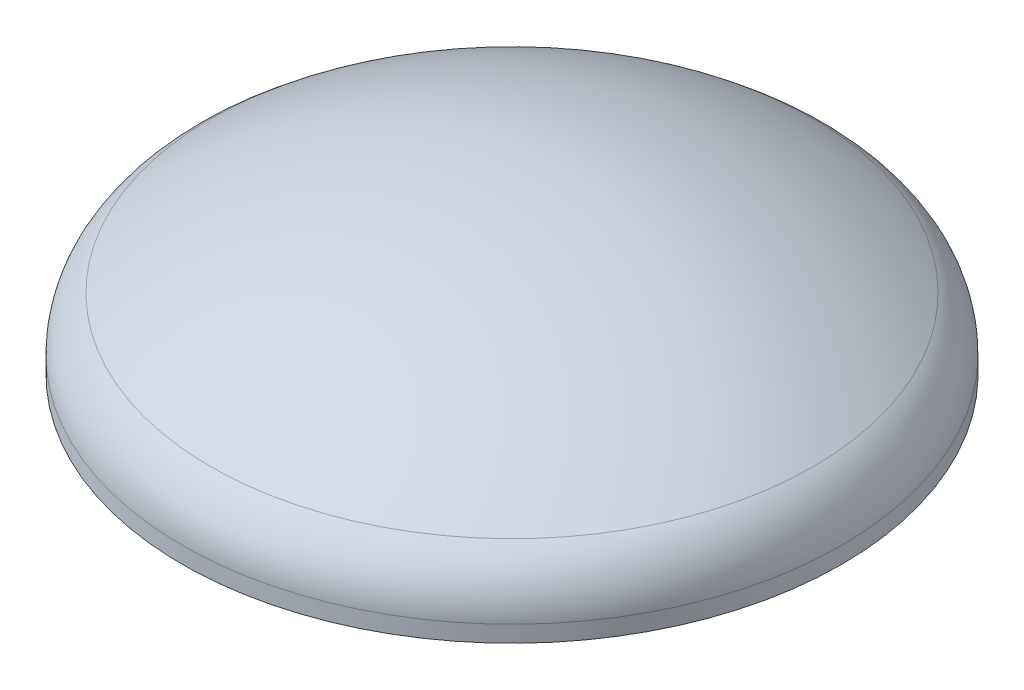
ISO-10303-21;
HEADER;
FILE_DESCRIPTION(('STEP AP214'),'2;1');
FILE_NAME('part.step','',(''),(''),'','','');
FILE_SCHEMA(('AUTOMOTIVE_DESIGN { 1 0 10303 214 1 1 1 1 }'));
ENDSEC;
DATA;
#1=APPLICATION_CONTEXT('core data for automotive mechanical design processes');
#2=APPLICATION_PROTOCOL_DEFINITION('international standard','automotive_design',2000,#1);
#3=PRODUCT_CONTEXT('',#1,'mechanical');
#4=PRODUCT('Part','Part','',(#3));
#5=PRODUCT_RELATED_PRODUCT_CATEGORY('part','',(#4));
#6=PRODUCT_DEFINITION_FORMATION('','',#4);
#7=PRODUCT_DEFINITION_CONTEXT('part definition',#1,'design');
#8=PRODUCT_DEFINITION('design','',#6,#7);
#9=PRODUCT_DEFINITION_SHAPE('','',#8);
#10=(LENGTH_UNIT() NAMED_UNIT(*) SI_UNIT(.MILLI.,.METRE.));
#11=(NAMED_UNIT(*) PLANE_ANGLE_UNIT() SI_UNIT($,.RADIAN.));
#12=(NAMED_UNIT(*) SI_UNIT($,.STERADIAN.) SOLID_ANGLE_UNIT());
#13=UNCERTAINTY_MEASURE_WITH_UNIT(LENGTH_MEASURE(1.E-05),#10,'distance_accuracy_value','');
#14=(GEOMETRIC_REPRESENTATION_CONTEXT(3) GLOBAL_UNCERTAINTY_ASSIGNED_CONTEXT((#13)) GLOBAL_UNIT_ASSIGNED_CONTEXT((#10,
#11,#12)) REPRESENTATION_CONTEXT('',''));
#15=CARTESIAN_POINT('',(0.,0.,0.));
#16=DIRECTION('',(0.,0.,1.));
#17=DIRECTION('',(1.,0.,0.));
#18=AXIS2_PLACEMENT_3D('',#15,#16,#17);
#19=CARTESIAN_POINT('',(0.,-558.247564888264,0.));
#20=DIRECTION('',(0.,1.,0.));
#21=DIRECTION('',(1.,0.,0.));
#22=AXIS2_PLACEMENT_3D('',#19,#20,#21);
#23=SPHERICAL_SURFACE('',#22,812.8);
#24=CARTESIAN_POINT('',(-2.66329047500934E-13,108.778223555467,0.));
#25=DIRECTION('',(0.,1.,0.));
#26=DIRECTION('',(-1.,0.,0.));
#27=AXIS2_PLACEMENT_3D('',#24,#25,#26);
#28=CIRCLE('',#27,464.457142857143);
#29=CARTESIAN_POINT('',(-464.457142857143,108.778223555467,0.));
#30=VERTEX_POINT('',#29);
#31=EDGE_CURVE('E10',#30,#30,#28,.T.);
#32=ORIENTED_EDGE('',*,*,#31,.T.);
#33=EDGE_LOOP('',(#32));
#34=FACE_BOUND('',#33,.T.);
#35=ADVANCED_FACE('F31',(#34),#23,.T.);
#36=CARTESIAN_POINT('',(-3.88578058618805E-13,25.4000000000005,0.));
#37=DIRECTION('',(0.,1.,0.));
#38=DIRECTION('',(-1.,0.,0.));
#39=AXIS2_PLACEMENT_3D('',#36,#37,#38);
#40=TOROIDAL_SURFACE('',#39,406.4,101.6);
#41=ORIENTED_EDGE('',*,*,#31,.F.);
#42=EDGE_LOOP('',(#41));
#43=FACE_BOUND('',#42,.T.);
#44=CARTESIAN_POINT('',(-3.63097232018504E-13,25.4000000000006,0.));
#45=DIRECTION('',(0.,1.,0.));
#46=DIRECTION('',(-1.,0.,0.));
#47=AXIS2_PLACEMENT_3D('',#44,#45,#46);
#48=CIRCLE('',#47,508.);
#49=CARTESIAN_POINT('',(-508.000000000001,25.4000000000012,0.));
#50=VERTEX_POINT('',#49);
#51=EDGE_CURVE('E37',#50,#50,#48,.T.);
#52=ORIENTED_EDGE('',*,*,#51,.T.);
#53=EDGE_LOOP('',(#52));
#54=FACE_BOUND('',#53,.T.);
#55=ADVANCED_FACE('F69',(#43,#54),#40,.T.);
#56=CARTESIAN_POINT('',(0.,254.552435111736,0.));
#57=DIRECTION('',(0.,1.,0.));
#58=DIRECTION('',(-1.,0.,0.));
#59=AXIS2_PLACEMENT_3D('',#56,#57,#58);
#60=CYLINDRICAL_SURFACE('',#59,508.);
#61=ORIENTED_EDGE('',*,*,#51,.F.);
#62=EDGE_LOOP('',(#61));
#63=FACE_BOUND('',#62,.T.);
#64=CARTESIAN_POINT('',(-3.92576294799342E-13,6.10622663543836E-13,0.));
#65=DIRECTION('',(0.,1.,0.));
#66=DIRECTION('',(-1.,0.,0.));
#67=AXIS2_PLACEMENT_3D('',#64,#65,#66);
#68=CIRCLE('',#67,508.);
#69=CARTESIAN_POINT('',(-508.000000000001,1.20020391916058E-12,0.));
#70=VERTEX_POINT('',#69);
#71=EDGE_CURVE('E41',#70,#70,#68,.T.);
#72=ORIENTED_EDGE('',*,*,#71,.T.);
#73=EDGE_LOOP('',(#72));
#74=FACE_BOUND('',#73,.T.);
#75=ADVANCED_FACE('F73',(#63,#74),#60,.T.);
#76=CARTESIAN_POINT('',(482.6,0.,0.));
#77=DIRECTION('',(0.,1.,0.));
#78=DIRECTION('',(-1.,0.,0.));
#79=AXIS2_PLACEMENT_3D('',#76,#77,#78);
#80=PLANE('',#79);
#81=ORIENTED_EDGE('',*,*,#71,.F.);
#82=EDGE_LOOP('',(#81));
#83=FACE_BOUND('',#82,.T.);
#84=CARTESIAN_POINT('',(-3.92576294799342E-13,5.55111512312578E-13,0.));
#85=DIRECTION('',(0.,1.,0.));
#86=DIRECTION('',(-1.,0.,0.));
#87=AXIS2_PLACEMENT_3D('',#84,#85,#86);
#88=CIRCLE('',#87,482.6);
#89=CARTESIAN_POINT('',(-482.600000000001,1.11521370514849E-12,0.));
#90=VERTEX_POINT('',#89);
#91=EDGE_CURVE('E45',#90,#90,#88,.T.);
#92=ORIENTED_EDGE('',*,*,#91,.T.);
#93=EDGE_LOOP('',(#92));
#94=FACE_BOUND('',#93,.T.);
#95=ADVANCED_FACE('F78',(#83,#94),#80,.F.);
#96=CARTESIAN_POINT('',(0.,254.552435111736,0.));
#97=DIRECTION('',(0.,1.,0.));
#98=DIRECTION('',(-1.,0.,0.));
#99=AXIS2_PLACEMENT_3D('',#96,#97,#98);
#100=CYLINDRICAL_SURFACE('',#99,482.6);
#101=ORIENTED_EDGE('',*,*,#91,.F.);
#102=EDGE_LOOP('',(#101));
#103=FACE_BOUND('',#102,.T.);
#104=CARTESIAN_POINT('',(-3.63097232018504E-13,25.4000000000006,0.));
#105=DIRECTION('',(0.,1.,0.));
#106=DIRECTION('',(-1.,0.,0.));
#107=AXIS2_PLACEMENT_3D('',#104,#105,#106);
#108=CIRCLE('',#107,482.6);
#109=CARTESIAN_POINT('',(-482.600000000001,25.4000000000011,0.));
#110=VERTEX_POINT('',#109);
#111=EDGE_CURVE('E50',#110,#110,#108,.T.);
#112=ORIENTED_EDGE('',*,*,#111,.T.);
#113=EDGE_LOOP('',(#112));
#114=FACE_BOUND('',#113,.T.);
#115=ADVANCED_FACE('F65',(#103,#114),#100,.F.);
#116=CARTESIAN_POINT('',(-3.88578058618805E-13,25.4000000000005,0.));
#117=DIRECTION('',(0.,1.,0.));
#118=DIRECTION('',(-1.,0.,0.));
#119=AXIS2_PLACEMENT_3D('',#116,#117,#118);
#120=TOROIDAL_SURFACE('',#119,406.4,76.2);
#121=ORIENTED_EDGE('',*,*,#111,.F.);
#122=EDGE_LOOP('',(#121));
#123=FACE_BOUND('',#122,.T.);
#124=CARTESIAN_POINT('',(-2.90521093630327E-13,87.9336676666002,0.));
#125=DIRECTION('',(0.,1.,0.));
#126=DIRECTION('',(-1.,0.,0.));
#127=AXIS2_PLACEMENT_3D('',#124,#125,#126);
#128=CIRCLE('',#127,449.942857142857);
#129=CARTESIAN_POINT('',(-449.942857142858,87.9336676666008,0.));
#130=VERTEX_POINT('',#129);
#131=EDGE_CURVE('E53',#130,#130,#128,.T.);
#132=ORIENTED_EDGE('',*,*,#131,.T.);
#133=EDGE_LOOP('',(#132));
#134=FACE_BOUND('',#133,.T.);
#135=ADVANCED_FACE('F57',(#123,#134),#120,.F.);
#136=CARTESIAN_POINT('',(0.,-558.247564888264,0.));
#137=DIRECTION('',(0.,1.,0.));
#138=DIRECTION('',(-1.,0.,0.));
#139=AXIS2_PLACEMENT_3D('',#136,#137,#138);
#140=SPHERICAL_SURFACE('',#139,787.4);
#141=ORIENTED_EDGE('',*,*,#131,.F.);
#142=EDGE_LOOP('',(#141));
#143=FACE_BOUND('',#142,.T.);
#144=ADVANCED_FACE('F59',(#143),#140,.F.);
#145=CLOSED_SHELL('',(#35,#55,#75,#95,#115,#135,#144));
#146=MANIFOLD_SOLID_BREP('B2',#145);
#147=ADVANCED_BREP_SHAPE_REPRESENTATION('',(#18,#146),#14);
#148=SHAPE_DEFINITION_REPRESENTATION(#9,#147);
ENDSEC;
END-ISO-10303-21;
